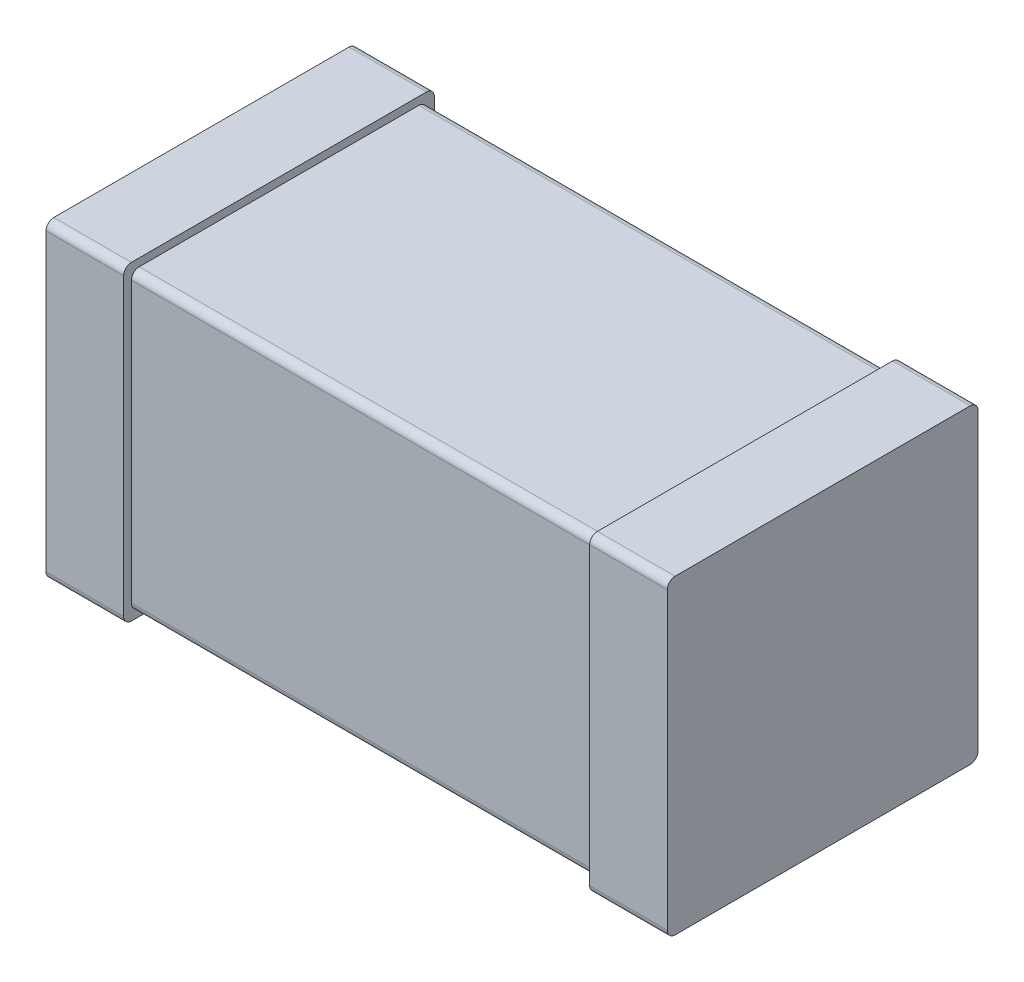
ISO-10303-21;
HEADER;
FILE_DESCRIPTION(('STEP AP214'),'2;1');
FILE_NAME('part.step','',(''),(''),'','','');
FILE_SCHEMA(('AUTOMOTIVE_DESIGN { 1 0 10303 214 1 1 1 1 }'));
ENDSEC;
DATA;
#1=APPLICATION_CONTEXT('core data for automotive mechanical design processes');
#2=APPLICATION_PROTOCOL_DEFINITION('international standard','automotive_design',2000,#1);
#3=PRODUCT_CONTEXT('',#1,'mechanical');
#4=PRODUCT('Part','Part','',(#3));
#5=PRODUCT_RELATED_PRODUCT_CATEGORY('part','',(#4));
#6=PRODUCT_DEFINITION_FORMATION('','',#4);
#7=PRODUCT_DEFINITION_CONTEXT('part definition',#1,'design');
#8=PRODUCT_DEFINITION('design','',#6,#7);
#9=PRODUCT_DEFINITION_SHAPE('','',#8);
#10=(LENGTH_UNIT() NAMED_UNIT(*) SI_UNIT(.MILLI.,.METRE.));
#11=(NAMED_UNIT(*) PLANE_ANGLE_UNIT() SI_UNIT($,.RADIAN.));
#12=(NAMED_UNIT(*) SI_UNIT($,.STERADIAN.) SOLID_ANGLE_UNIT());
#13=UNCERTAINTY_MEASURE_WITH_UNIT(LENGTH_MEASURE(1.E-05),#10,'distance_accuracy_value','');
#14=(GEOMETRIC_REPRESENTATION_CONTEXT(3) GLOBAL_UNCERTAINTY_ASSIGNED_CONTEXT((#13)) GLOBAL_UNIT_ASSIGNED_CONTEXT((#10,
#11,#12)) REPRESENTATION_CONTEXT('',''));
#15=CARTESIAN_POINT('',(0.,0.,0.));
#16=DIRECTION('',(0.,0.,1.));
#17=DIRECTION('',(1.,0.,0.));
#18=AXIS2_PLACEMENT_3D('',#15,#16,#17);
#19=CARTESIAN_POINT('',(-1.6,-0.8,0.));
#20=DIRECTION('',(1.,0.,0.));
#21=DIRECTION('',(0.,1.,0.));
#22=AXIS2_PLACEMENT_3D('',#19,#20,#21);
#23=PLANE('',#22);
#24=CARTESIAN_POINT('',(-1.6,-0.76,1.56));
#25=DIRECTION('',(-1.,0.,0.));
#26=DIRECTION('',(0.,0.,1.));
#27=AXIS2_PLACEMENT_3D('',#24,#25,#26);
#28=CIRCLE('',#27,0.04);
#29=CARTESIAN_POINT('',(-1.6,-0.8,1.56));
#30=VERTEX_POINT('',#29);
#31=CARTESIAN_POINT('',(-1.6,-0.76,1.6));
#32=VERTEX_POINT('',#31);
#33=EDGE_CURVE('E11',#30,#32,#28,.T.);
#34=ORIENTED_EDGE('',*,*,#33,.T.);
#35=DIRECTION('',(0.,1.,0.));
#36=VECTOR('',#35,1.);
#37=CARTESIAN_POINT('',(-1.6,-0.8,1.6));
#38=LINE('',#37,#36);
#39=CARTESIAN_POINT('',(-1.6,0.76,1.6));
#40=VERTEX_POINT('',#39);
#41=EDGE_CURVE('E27',#32,#40,#38,.T.);
#42=ORIENTED_EDGE('',*,*,#41,.T.);
#43=CARTESIAN_POINT('',(-1.6,0.76,1.56));
#44=DIRECTION('',(1.,0.,0.));
#45=DIRECTION('',(0.,0.,1.));
#46=AXIS2_PLACEMENT_3D('',#43,#44,#45);
#47=CIRCLE('',#46,0.04);
#48=CARTESIAN_POINT('',(-1.6,0.8,1.56));
#49=VERTEX_POINT('',#48);
#50=EDGE_CURVE('E420',#49,#40,#47,.T.);
#51=ORIENTED_EDGE('',*,*,#50,.F.);
#52=DIRECTION('',(0.,0.,1.));
#53=VECTOR('',#52,1.);
#54=CARTESIAN_POINT('',(-1.6,0.8,0.));
#55=LINE('',#54,#53);
#56=CARTESIAN_POINT('',(-1.6,0.8,0.04));
#57=VERTEX_POINT('',#56);
#58=EDGE_CURVE('E253',#57,#49,#55,.T.);
#59=ORIENTED_EDGE('',*,*,#58,.F.);
#60=CARTESIAN_POINT('',(-1.6,0.76,0.04));
#61=DIRECTION('',(-1.,0.,0.));
#62=DIRECTION('',(0.,0.,1.));
#63=AXIS2_PLACEMENT_3D('',#60,#61,#62);
#64=CIRCLE('',#63,0.04);
#65=CARTESIAN_POINT('',(-1.6,0.76,0.));
#66=VERTEX_POINT('',#65);
#67=EDGE_CURVE('E292',#57,#66,#64,.T.);
#68=ORIENTED_EDGE('',*,*,#67,.T.);
#69=DIRECTION('',(0.,1.,0.));
#70=VECTOR('',#69,1.);
#71=CARTESIAN_POINT('',(-1.6,-0.8,0.));
#72=LINE('',#71,#70);
#73=CARTESIAN_POINT('',(-1.6,-0.76,0.));
#74=VERTEX_POINT('',#73);
#75=EDGE_CURVE('E309',#74,#66,#72,.T.);
#76=ORIENTED_EDGE('',*,*,#75,.F.);
#77=CARTESIAN_POINT('',(-1.6,-0.76,0.04));
#78=DIRECTION('',(1.,0.,0.));
#79=DIRECTION('',(0.,0.,1.));
#80=AXIS2_PLACEMENT_3D('',#77,#78,#79);
#81=CIRCLE('',#80,0.04);
#82=CARTESIAN_POINT('',(-1.6,-0.8,0.04));
#83=VERTEX_POINT('',#82);
#84=EDGE_CURVE('E230',#83,#74,#81,.T.);
#85=ORIENTED_EDGE('',*,*,#84,.F.);
#86=DIRECTION('',(0.,0.,1.));
#87=VECTOR('',#86,1.);
#88=CARTESIAN_POINT('',(-1.6,-0.8,0.));
#89=LINE('',#88,#87);
#90=EDGE_CURVE('E235',#83,#30,#89,.T.);
#91=ORIENTED_EDGE('',*,*,#90,.T.);
#92=EDGE_LOOP('',(#34,#42,#51,#59,#68,#76,#85,#91));
#93=FACE_BOUND('',#92,.T.);
#94=ADVANCED_FACE('F16',(#93),#23,.F.);
#95=CARTESIAN_POINT('',(-1.6,-0.8,0.));
#96=DIRECTION('',(0.,1.,0.));
#97=DIRECTION('',(1.,0.,0.));
#98=AXIS2_PLACEMENT_3D('',#95,#96,#97);
#99=PLANE('',#98);
#100=DIRECTION('',(1.,0.,0.));
#101=VECTOR('',#100,1.);
#102=CARTESIAN_POINT('',(-1.6,-0.8,1.56));
#103=LINE('',#102,#101);
#104=CARTESIAN_POINT('',(-1.2,-0.8,1.56));
#105=VERTEX_POINT('',#104);
#106=EDGE_CURVE('E286',#30,#105,#103,.T.);
#107=ORIENTED_EDGE('',*,*,#106,.F.);
#108=ORIENTED_EDGE('',*,*,#90,.F.);
#109=DIRECTION('',(1.,0.,0.));
#110=VECTOR('',#109,1.);
#111=CARTESIAN_POINT('',(-1.6,-0.8,0.04));
#112=LINE('',#111,#110);
#113=CARTESIAN_POINT('',(-1.2,-0.8,0.04));
#114=VERTEX_POINT('',#113);
#115=EDGE_CURVE('E229',#83,#114,#112,.T.);
#116=ORIENTED_EDGE('',*,*,#115,.T.);
#117=DIRECTION('',(0.,0.,1.));
#118=VECTOR('',#117,1.);
#119=CARTESIAN_POINT('',(-1.2,-0.8,0.));
#120=LINE('',#119,#118);
#121=EDGE_CURVE('E220',#114,#105,#120,.T.);
#122=ORIENTED_EDGE('',*,*,#121,.T.);
#123=EDGE_LOOP('',(#107,#108,#116,#122));
#124=FACE_BOUND('',#123,.T.);
#125=ADVANCED_FACE('F234',(#124),#99,.F.);
#126=CARTESIAN_POINT('',(-1.6,-0.76,0.04));
#127=DIRECTION('',(1.,0.,0.));
#128=DIRECTION('',(0.,-1.,0.));
#129=AXIS2_PLACEMENT_3D('',#126,#127,#128);
#130=CYLINDRICAL_SURFACE('',#129,0.04);
#131=ORIENTED_EDGE('',*,*,#84,.T.);
#132=DIRECTION('',(1.,0.,0.));
#133=VECTOR('',#132,1.);
#134=CARTESIAN_POINT('',(-1.6,-0.76,0.));
#135=LINE('',#134,#133);
#136=CARTESIAN_POINT('',(-1.2,-0.76,0.));
#137=VERTEX_POINT('',#136);
#138=EDGE_CURVE('E242',#74,#137,#135,.T.);
#139=ORIENTED_EDGE('',*,*,#138,.T.);
#140=CARTESIAN_POINT('',(-1.2,-0.76,0.04));
#141=DIRECTION('',(1.,0.,0.));
#142=DIRECTION('',(0.,0.,1.));
#143=AXIS2_PLACEMENT_3D('',#140,#141,#142);
#144=CIRCLE('',#143,0.04);
#145=EDGE_CURVE('E159',#114,#137,#144,.T.);
#146=ORIENTED_EDGE('',*,*,#145,.F.);
#147=ORIENTED_EDGE('',*,*,#115,.F.);
#148=EDGE_LOOP('',(#131,#139,#146,#147));
#149=FACE_BOUND('',#148,.T.);
#150=ADVANCED_FACE('F240',(#149),#130,.T.);
#151=CARTESIAN_POINT('',(-1.6,-0.76,1.56));
#152=DIRECTION('',(1.,0.,0.));
#153=DIRECTION('',(0.,-1.,0.));
#154=AXIS2_PLACEMENT_3D('',#151,#152,#153);
#155=CYLINDRICAL_SURFACE('',#154,0.04);
#156=ORIENTED_EDGE('',*,*,#106,.T.);
#157=CARTESIAN_POINT('',(-1.2,-0.76,1.56));
#158=DIRECTION('',(-1.,0.,0.));
#159=DIRECTION('',(0.,0.,1.));
#160=AXIS2_PLACEMENT_3D('',#157,#158,#159);
#161=CIRCLE('',#160,0.04);
#162=CARTESIAN_POINT('',(-1.2,-0.76,1.6));
#163=VERTEX_POINT('',#162);
#164=EDGE_CURVE('E225',#105,#163,#161,.T.);
#165=ORIENTED_EDGE('',*,*,#164,.T.);
#166=DIRECTION('',(1.,0.,0.));
#167=VECTOR('',#166,1.);
#168=CARTESIAN_POINT('',(-1.6,-0.76,1.6));
#169=LINE('',#168,#167);
#170=EDGE_CURVE('E172',#32,#163,#169,.T.);
#171=ORIENTED_EDGE('',*,*,#170,.F.);
#172=ORIENTED_EDGE('',*,*,#33,.F.);
#173=EDGE_LOOP('',(#156,#165,#171,#172));
#174=FACE_BOUND('',#173,.T.);
#175=ADVANCED_FACE('F502',(#174),#155,.T.);
#176=CARTESIAN_POINT('',(-1.6,-0.8,0.));
#177=DIRECTION('',(0.,0.,1.));
#178=DIRECTION('',(1.,0.,0.));
#179=AXIS2_PLACEMENT_3D('',#176,#177,#178);
#180=PLANE('',#179);
#181=DIRECTION('',(1.,0.,0.));
#182=VECTOR('',#181,1.);
#183=CARTESIAN_POINT('',(-1.6,0.76,0.));
#184=LINE('',#183,#182);
#185=CARTESIAN_POINT('',(-1.2,0.76,0.));
#186=VERTEX_POINT('',#185);
#187=EDGE_CURVE('E504',#66,#186,#184,.T.);
#188=ORIENTED_EDGE('',*,*,#187,.T.);
#189=DIRECTION('',(0.,1.,0.));
#190=VECTOR('',#189,1.);
#191=CARTESIAN_POINT('',(-1.2,-0.8,0.));
#192=LINE('',#191,#190);
#193=EDGE_CURVE('E246',#137,#186,#192,.T.);
#194=ORIENTED_EDGE('',*,*,#193,.F.);
#195=ORIENTED_EDGE('',*,*,#138,.F.);
#196=ORIENTED_EDGE('',*,*,#75,.T.);
#197=EDGE_LOOP('',(#188,#194,#195,#196));
#198=FACE_BOUND('',#197,.T.);
#199=ADVANCED_FACE('F519',(#198),#180,.F.);
#200=CARTESIAN_POINT('',(-1.6,-0.8,1.6));
#201=DIRECTION('',(0.,0.,1.));
#202=DIRECTION('',(1.,0.,0.));
#203=AXIS2_PLACEMENT_3D('',#200,#201,#202);
#204=PLANE('',#203);
#205=ORIENTED_EDGE('',*,*,#41,.F.);
#206=ORIENTED_EDGE('',*,*,#170,.T.);
#207=DIRECTION('',(0.,1.,0.));
#208=VECTOR('',#207,1.);
#209=CARTESIAN_POINT('',(-1.2,-0.8,1.6));
#210=LINE('',#209,#208);
#211=CARTESIAN_POINT('',(-1.2,0.76,1.6));
#212=VERTEX_POINT('',#211);
#213=EDGE_CURVE('E265',#163,#212,#210,.T.);
#214=ORIENTED_EDGE('',*,*,#213,.T.);
#215=DIRECTION('',(1.,0.,0.));
#216=VECTOR('',#215,1.);
#217=CARTESIAN_POINT('',(-1.6,0.76,1.6));
#218=LINE('',#217,#216);
#219=EDGE_CURVE('E330',#40,#212,#218,.T.);
#220=ORIENTED_EDGE('',*,*,#219,.F.);
#221=EDGE_LOOP('',(#205,#206,#214,#220));
#222=FACE_BOUND('',#221,.T.);
#223=ADVANCED_FACE('F491',(#222),#204,.T.);
#224=CARTESIAN_POINT('',(-1.6,0.76,0.04));
#225=DIRECTION('',(1.,0.,0.));
#226=DIRECTION('',(0.,1.,0.));
#227=AXIS2_PLACEMENT_3D('',#224,#225,#226);
#228=CYLINDRICAL_SURFACE('',#227,0.04);
#229=DIRECTION('',(1.,0.,0.));
#230=VECTOR('',#229,1.);
#231=CARTESIAN_POINT('',(-1.6,0.8,0.04));
#232=LINE('',#231,#230);
#233=CARTESIAN_POINT('',(-1.2,0.8,0.04));
#234=VERTEX_POINT('',#233);
#235=EDGE_CURVE('E262',#57,#234,#232,.T.);
#236=ORIENTED_EDGE('',*,*,#235,.T.);
#237=CARTESIAN_POINT('',(-1.2,0.76,0.04));
#238=DIRECTION('',(-1.,0.,0.));
#239=DIRECTION('',(0.,0.,1.));
#240=AXIS2_PLACEMENT_3D('',#237,#238,#239);
#241=CIRCLE('',#240,0.04);
#242=EDGE_CURVE('E266',#234,#186,#241,.T.);
#243=ORIENTED_EDGE('',*,*,#242,.T.);
#244=ORIENTED_EDGE('',*,*,#187,.F.);
#245=ORIENTED_EDGE('',*,*,#67,.F.);
#246=EDGE_LOOP('',(#236,#243,#244,#245));
#247=FACE_BOUND('',#246,.T.);
#248=ADVANCED_FACE('F522',(#247),#228,.T.);
#249=CARTESIAN_POINT('',(-1.6,0.76,1.56));
#250=DIRECTION('',(1.,0.,0.));
#251=DIRECTION('',(0.,1.,0.));
#252=AXIS2_PLACEMENT_3D('',#249,#250,#251);
#253=CYLINDRICAL_SURFACE('',#252,0.04);
#254=ORIENTED_EDGE('',*,*,#50,.T.);
#255=ORIENTED_EDGE('',*,*,#219,.T.);
#256=CARTESIAN_POINT('',(-1.2,0.76,1.56));
#257=DIRECTION('',(1.,0.,0.));
#258=DIRECTION('',(0.,0.,1.));
#259=AXIS2_PLACEMENT_3D('',#256,#257,#258);
#260=CIRCLE('',#259,0.04);
#261=CARTESIAN_POINT('',(-1.2,0.8,1.56));
#262=VERTEX_POINT('',#261);
#263=EDGE_CURVE('E267',#262,#212,#260,.T.);
#264=ORIENTED_EDGE('',*,*,#263,.F.);
#265=DIRECTION('',(1.,0.,0.));
#266=VECTOR('',#265,1.);
#267=CARTESIAN_POINT('',(-1.6,0.8,1.56));
#268=LINE('',#267,#266);
#269=EDGE_CURVE('E245',#49,#262,#268,.T.);
#270=ORIENTED_EDGE('',*,*,#269,.F.);
#271=EDGE_LOOP('',(#254,#255,#264,#270));
#272=FACE_BOUND('',#271,.T.);
#273=ADVANCED_FACE('F488',(#272),#253,.T.);
#274=CARTESIAN_POINT('',(-1.6,0.8,0.));
#275=DIRECTION('',(0.,1.,0.));
#276=DIRECTION('',(1.,0.,0.));
#277=AXIS2_PLACEMENT_3D('',#274,#275,#276);
#278=PLANE('',#277);
#279=DIRECTION('',(0.,0.,1.));
#280=VECTOR('',#279,1.);
#281=CARTESIAN_POINT('',(-1.2,0.8,0.));
#282=LINE('',#281,#280);
#283=EDGE_CURVE('E256',#234,#262,#282,.T.);
#284=ORIENTED_EDGE('',*,*,#283,.F.);
#285=ORIENTED_EDGE('',*,*,#235,.F.);
#286=ORIENTED_EDGE('',*,*,#58,.T.);
#287=ORIENTED_EDGE('',*,*,#269,.T.);
#288=EDGE_LOOP('',(#284,#285,#286,#287));
#289=FACE_BOUND('',#288,.T.);
#290=ADVANCED_FACE('F496',(#289),#278,.T.);
#291=CARTESIAN_POINT('',(-1.2,-0.8,0.));
#292=DIRECTION('',(1.,0.,0.));
#293=DIRECTION('',(0.,1.,0.));
#294=AXIS2_PLACEMENT_3D('',#291,#292,#293);
#295=PLANE('',#294);
#296=ORIENTED_EDGE('',*,*,#121,.F.);
#297=ORIENTED_EDGE('',*,*,#145,.T.);
#298=ORIENTED_EDGE('',*,*,#193,.T.);
#299=ORIENTED_EDGE('',*,*,#242,.F.);
#300=ORIENTED_EDGE('',*,*,#283,.T.);
#301=ORIENTED_EDGE('',*,*,#263,.T.);
#302=ORIENTED_EDGE('',*,*,#213,.F.);
#303=ORIENTED_EDGE('',*,*,#164,.F.);
#304=EDGE_LOOP('',(#296,#297,#298,#299,#300,#301,#302,#303));
#305=FACE_BOUND('',#304,.T.);
#306=CARTESIAN_POINT('',(-1.2,-0.72,0.08));
#307=DIRECTION('',(1.,0.,0.));
#308=DIRECTION('',(0.,0.,1.));
#309=AXIS2_PLACEMENT_3D('',#306,#307,#308);
#310=CIRCLE('',#309,0.04);
#311=CARTESIAN_POINT('',(-1.2,-0.76,0.08));
#312=VERTEX_POINT('',#311);
#313=CARTESIAN_POINT('',(-1.2,-0.72,0.04));
#314=VERTEX_POINT('',#313);
#315=EDGE_CURVE('E346',#312,#314,#310,.T.);
#316=ORIENTED_EDGE('',*,*,#315,.F.);
#317=DIRECTION('',(0.,0.,1.));
#318=VECTOR('',#317,1.);
#319=CARTESIAN_POINT('',(-1.2,-0.76,0.04));
#320=LINE('',#319,#318);
#321=CARTESIAN_POINT('',(-1.2,-0.76,1.52));
#322=VERTEX_POINT('',#321);
#323=EDGE_CURVE('E271',#312,#322,#320,.T.);
#324=ORIENTED_EDGE('',*,*,#323,.T.);
#325=CARTESIAN_POINT('',(-1.2,-0.72,1.52));
#326=DIRECTION('',(-1.,0.,0.));
#327=DIRECTION('',(0.,0.,1.));
#328=AXIS2_PLACEMENT_3D('',#325,#326,#327);
#329=CIRCLE('',#328,0.04);
#330=CARTESIAN_POINT('',(-1.2,-0.72,1.56));
#331=VERTEX_POINT('',#330);
#332=EDGE_CURVE('E331',#322,#331,#329,.T.);
#333=ORIENTED_EDGE('',*,*,#332,.T.);
#334=DIRECTION('',(0.,1.,0.));
#335=VECTOR('',#334,1.);
#336=CARTESIAN_POINT('',(-1.2,-0.76,1.56));
#337=LINE('',#336,#335);
#338=CARTESIAN_POINT('',(-1.2,0.72,1.56));
#339=VERTEX_POINT('',#338);
#340=EDGE_CURVE('E335',#331,#339,#337,.T.);
#341=ORIENTED_EDGE('',*,*,#340,.T.);
#342=CARTESIAN_POINT('',(-1.2,0.72,1.52));
#343=DIRECTION('',(1.,0.,0.));
#344=DIRECTION('',(0.,0.,1.));
#345=AXIS2_PLACEMENT_3D('',#342,#343,#344);
#346=CIRCLE('',#345,0.04);
#347=CARTESIAN_POINT('',(-1.2,0.76,1.52));
#348=VERTEX_POINT('',#347);
#349=EDGE_CURVE('E282',#348,#339,#346,.T.);
#350=ORIENTED_EDGE('',*,*,#349,.F.);
#351=DIRECTION('',(0.,0.,1.));
#352=VECTOR('',#351,1.);
#353=CARTESIAN_POINT('',(-1.2,0.76,0.04));
#354=LINE('',#353,#352);
#355=CARTESIAN_POINT('',(-1.2,0.76,0.08));
#356=VERTEX_POINT('',#355);
#357=EDGE_CURVE('E277',#356,#348,#354,.T.);
#358=ORIENTED_EDGE('',*,*,#357,.F.);
#359=CARTESIAN_POINT('',(-1.2,0.72,0.08));
#360=DIRECTION('',(-1.,0.,0.));
#361=DIRECTION('',(0.,0.,1.));
#362=AXIS2_PLACEMENT_3D('',#359,#360,#361);
#363=CIRCLE('',#362,0.04);
#364=CARTESIAN_POINT('',(-1.2,0.72,0.04));
#365=VERTEX_POINT('',#364);
#366=EDGE_CURVE('E342',#356,#365,#363,.T.);
#367=ORIENTED_EDGE('',*,*,#366,.T.);
#368=DIRECTION('',(0.,1.,0.));
#369=VECTOR('',#368,1.);
#370=CARTESIAN_POINT('',(-1.2,-0.76,0.04));
#371=LINE('',#370,#369);
#372=EDGE_CURVE('E381',#314,#365,#371,.T.);
#373=ORIENTED_EDGE('',*,*,#372,.F.);
#374=EDGE_LOOP('',(#316,#324,#333,#341,#350,#358,#367,#373));
#375=FACE_BOUND('',#374,.T.);
#376=ADVANCED_FACE('F222',(#305,#375),#295,.T.);
#377=CARTESIAN_POINT('',(-1.2,-0.72,0.08));
#378=DIRECTION('',(1.,0.,0.));
#379=DIRECTION('',(0.,-1.,0.));
#380=AXIS2_PLACEMENT_3D('',#377,#378,#379);
#381=CYLINDRICAL_SURFACE('',#380,0.04);
#382=ORIENTED_EDGE('',*,*,#315,.T.);
#383=DIRECTION('',(1.,0.,0.));
#384=VECTOR('',#383,1.);
#385=CARTESIAN_POINT('',(-1.2,-0.72,0.04));
#386=LINE('',#385,#384);
#387=CARTESIAN_POINT('',(1.2,-0.72,0.04));
#388=VERTEX_POINT('',#387);
#389=EDGE_CURVE('E380',#314,#388,#386,.T.);
#390=ORIENTED_EDGE('',*,*,#389,.T.);
#391=CARTESIAN_POINT('',(1.2,-0.72,0.08));
#392=DIRECTION('',(1.,0.,0.));
#393=DIRECTION('',(0.,0.,1.));
#394=AXIS2_PLACEMENT_3D('',#391,#392,#393);
#395=CIRCLE('',#394,0.04);
#396=CARTESIAN_POINT('',(1.2,-0.76,0.08));
#397=VERTEX_POINT('',#396);
#398=EDGE_CURVE('E128',#397,#388,#395,.T.);
#399=ORIENTED_EDGE('',*,*,#398,.F.);
#400=DIRECTION('',(1.,0.,0.));
#401=VECTOR('',#400,1.);
#402=CARTESIAN_POINT('',(-1.2,-0.76,0.08));
#403=LINE('',#402,#401);
#404=EDGE_CURVE('E340',#312,#397,#403,.T.);
#405=ORIENTED_EDGE('',*,*,#404,.F.);
#406=EDGE_LOOP('',(#382,#390,#399,#405));
#407=FACE_BOUND('',#406,.T.);
#408=ADVANCED_FACE('F548',(#407),#381,.T.);
#409=CARTESIAN_POINT('',(-1.2,-0.76,0.04));
#410=DIRECTION('',(0.,0.,1.));
#411=DIRECTION('',(1.,0.,0.));
#412=AXIS2_PLACEMENT_3D('',#409,#410,#411);
#413=PLANE('',#412);
#414=DIRECTION('',(1.,0.,0.));
#415=VECTOR('',#414,1.);
#416=CARTESIAN_POINT('',(-1.2,0.72,0.04));
#417=LINE('',#416,#415);
#418=CARTESIAN_POINT('',(1.2,0.72,0.04));
#419=VERTEX_POINT('',#418);
#420=EDGE_CURVE('E377',#365,#419,#417,.T.);
#421=ORIENTED_EDGE('',*,*,#420,.T.);
#422=DIRECTION('',(0.,1.,0.));
#423=VECTOR('',#422,1.);
#424=CARTESIAN_POINT('',(1.2,-0.76,0.04));
#425=LINE('',#424,#423);
#426=EDGE_CURVE('E141',#388,#419,#425,.T.);
#427=ORIENTED_EDGE('',*,*,#426,.F.);
#428=ORIENTED_EDGE('',*,*,#389,.F.);
#429=ORIENTED_EDGE('',*,*,#372,.T.);
#430=EDGE_LOOP('',(#421,#427,#428,#429));
#431=FACE_BOUND('',#430,.T.);
#432=ADVANCED_FACE('F573',(#431),#413,.F.);
#433=CARTESIAN_POINT('',(-1.2,0.72,0.08));
#434=DIRECTION('',(1.,0.,0.));
#435=DIRECTION('',(0.,1.,0.));
#436=AXIS2_PLACEMENT_3D('',#433,#434,#435);
#437=CYLINDRICAL_SURFACE('',#436,0.04);
#438=DIRECTION('',(1.,0.,0.));
#439=VECTOR('',#438,1.);
#440=CARTESIAN_POINT('',(-1.2,0.76,0.08));
#441=LINE('',#440,#439);
#442=CARTESIAN_POINT('',(1.2,0.76,0.08));
#443=VERTEX_POINT('',#442);
#444=EDGE_CURVE('E276',#356,#443,#441,.T.);
#445=ORIENTED_EDGE('',*,*,#444,.T.);
#446=CARTESIAN_POINT('',(1.2,0.72,0.08));
#447=DIRECTION('',(-1.,0.,0.));
#448=DIRECTION('',(0.,0.,1.));
#449=AXIS2_PLACEMENT_3D('',#446,#447,#448);
#450=CIRCLE('',#449,0.04);
#451=EDGE_CURVE('E272',#443,#419,#450,.T.);
#452=ORIENTED_EDGE('',*,*,#451,.T.);
#453=ORIENTED_EDGE('',*,*,#420,.F.);
#454=ORIENTED_EDGE('',*,*,#366,.F.);
#455=EDGE_LOOP('',(#445,#452,#453,#454));
#456=FACE_BOUND('',#455,.T.);
#457=ADVANCED_FACE('F575',(#456),#437,.T.);
#458=CARTESIAN_POINT('',(-1.2,0.76,0.04));
#459=DIRECTION('',(0.,1.,0.));
#460=DIRECTION('',(1.,0.,0.));
#461=AXIS2_PLACEMENT_3D('',#458,#459,#460);
#462=PLANE('',#461);
#463=DIRECTION('',(0.,0.,1.));
#464=VECTOR('',#463,1.);
#465=CARTESIAN_POINT('',(1.2,0.76,0.04));
#466=LINE('',#465,#464);
#467=CARTESIAN_POINT('',(1.2,0.76,1.52));
#468=VERTEX_POINT('',#467);
#469=EDGE_CURVE('E321',#443,#468,#466,.T.);
#470=ORIENTED_EDGE('',*,*,#469,.F.);
#471=ORIENTED_EDGE('',*,*,#444,.F.);
#472=ORIENTED_EDGE('',*,*,#357,.T.);
#473=DIRECTION('',(1.,0.,0.));
#474=VECTOR('',#473,1.);
#475=CARTESIAN_POINT('',(-1.2,0.76,1.52));
#476=LINE('',#475,#474);
#477=EDGE_CURVE('E312',#348,#468,#476,.T.);
#478=ORIENTED_EDGE('',*,*,#477,.T.);
#479=EDGE_LOOP('',(#470,#471,#472,#478));
#480=FACE_BOUND('',#479,.T.);
#481=ADVANCED_FACE('F580',(#480),#462,.T.);
#482=CARTESIAN_POINT('',(-1.2,0.72,1.52));
#483=DIRECTION('',(1.,0.,0.));
#484=DIRECTION('',(0.,1.,0.));
#485=AXIS2_PLACEMENT_3D('',#482,#483,#484);
#486=CYLINDRICAL_SURFACE('',#485,0.04);
#487=ORIENTED_EDGE('',*,*,#349,.T.);
#488=DIRECTION('',(1.,0.,0.));
#489=VECTOR('',#488,1.);
#490=CARTESIAN_POINT('',(-1.2,0.72,1.56));
#491=LINE('',#490,#489);
#492=CARTESIAN_POINT('',(1.2,0.72,1.56));
#493=VERTEX_POINT('',#492);
#494=EDGE_CURVE('E278',#339,#493,#491,.T.);
#495=ORIENTED_EDGE('',*,*,#494,.T.);
#496=CARTESIAN_POINT('',(1.2,0.72,1.52));
#497=DIRECTION('',(1.,0.,0.));
#498=DIRECTION('',(0.,0.,1.));
#499=AXIS2_PLACEMENT_3D('',#496,#497,#498);
#500=CIRCLE('',#499,0.04);
#501=EDGE_CURVE('E319',#468,#493,#500,.T.);
#502=ORIENTED_EDGE('',*,*,#501,.F.);
#503=ORIENTED_EDGE('',*,*,#477,.F.);
#504=EDGE_LOOP('',(#487,#495,#502,#503));
#505=FACE_BOUND('',#504,.T.);
#506=ADVANCED_FACE('F583',(#505),#486,.T.);
#507=CARTESIAN_POINT('',(-1.2,-0.76,1.56));
#508=DIRECTION('',(0.,0.,1.));
#509=DIRECTION('',(1.,0.,0.));
#510=AXIS2_PLACEMENT_3D('',#507,#508,#509);
#511=PLANE('',#510);
#512=ORIENTED_EDGE('',*,*,#340,.F.);
#513=DIRECTION('',(1.,0.,0.));
#514=VECTOR('',#513,1.);
#515=CARTESIAN_POINT('',(-1.2,-0.72,1.56));
#516=LINE('',#515,#514);
#517=CARTESIAN_POINT('',(1.2,-0.72,1.56));
#518=VERTEX_POINT('',#517);
#519=EDGE_CURVE('E283',#331,#518,#516,.T.);
#520=ORIENTED_EDGE('',*,*,#519,.T.);
#521=DIRECTION('',(0.,1.,0.));
#522=VECTOR('',#521,1.);
#523=CARTESIAN_POINT('',(1.2,-0.76,1.56));
#524=LINE('',#523,#522);
#525=EDGE_CURVE('E67',#518,#493,#524,.T.);
#526=ORIENTED_EDGE('',*,*,#525,.T.);
#527=ORIENTED_EDGE('',*,*,#494,.F.);
#528=EDGE_LOOP('',(#512,#520,#526,#527));
#529=FACE_BOUND('',#528,.T.);
#530=ADVANCED_FACE('F587',(#529),#511,.T.);
#531=CARTESIAN_POINT('',(-1.2,-0.72,1.52));
#532=DIRECTION('',(1.,0.,0.));
#533=DIRECTION('',(0.,-1.,0.));
#534=AXIS2_PLACEMENT_3D('',#531,#532,#533);
#535=CYLINDRICAL_SURFACE('',#534,0.04);
#536=DIRECTION('',(1.,0.,0.));
#537=VECTOR('',#536,1.);
#538=CARTESIAN_POINT('',(-1.2,-0.76,1.52));
#539=LINE('',#538,#537);
#540=CARTESIAN_POINT('',(1.2,-0.76,1.52));
#541=VERTEX_POINT('',#540);
#542=EDGE_CURVE('E325',#322,#541,#539,.T.);
#543=ORIENTED_EDGE('',*,*,#542,.T.);
#544=CARTESIAN_POINT('',(1.2,-0.72,1.52));
#545=DIRECTION('',(-1.,0.,0.));
#546=DIRECTION('',(0.,0.,1.));
#547=AXIS2_PLACEMENT_3D('',#544,#545,#546);
#548=CIRCLE('',#547,0.04);
#549=EDGE_CURVE('E80',#541,#518,#548,.T.);
#550=ORIENTED_EDGE('',*,*,#549,.T.);
#551=ORIENTED_EDGE('',*,*,#519,.F.);
#552=ORIENTED_EDGE('',*,*,#332,.F.);
#553=EDGE_LOOP('',(#543,#550,#551,#552));
#554=FACE_BOUND('',#553,.T.);
#555=ADVANCED_FACE('F564',(#554),#535,.T.);
#556=CARTESIAN_POINT('',(-1.2,-0.76,0.04));
#557=DIRECTION('',(0.,1.,0.));
#558=DIRECTION('',(1.,0.,0.));
#559=AXIS2_PLACEMENT_3D('',#556,#557,#558);
#560=PLANE('',#559);
#561=ORIENTED_EDGE('',*,*,#542,.F.);
#562=ORIENTED_EDGE('',*,*,#323,.F.);
#563=ORIENTED_EDGE('',*,*,#404,.T.);
#564=DIRECTION('',(0.,0.,1.));
#565=VECTOR('',#564,1.);
#566=CARTESIAN_POINT('',(1.2,-0.76,0.04));
#567=LINE('',#566,#565);
#568=EDGE_CURVE('E336',#397,#541,#567,.T.);
#569=ORIENTED_EDGE('',*,*,#568,.T.);
#570=EDGE_LOOP('',(#561,#562,#563,#569));
#571=FACE_BOUND('',#570,.T.);
#572=ADVANCED_FACE('F561',(#571),#560,.F.);
#573=CARTESIAN_POINT('',(1.2,-0.8,0.));
#574=DIRECTION('',(1.,0.,0.));
#575=DIRECTION('',(0.,1.,0.));
#576=AXIS2_PLACEMENT_3D('',#573,#574,#575);
#577=PLANE('',#576);
#578=CARTESIAN_POINT('',(1.2,-0.76,1.56));
#579=DIRECTION('',(-1.,0.,0.));
#580=DIRECTION('',(0.,0.,1.));
#581=AXIS2_PLACEMENT_3D('',#578,#579,#580);
#582=CIRCLE('',#581,0.04);
#583=CARTESIAN_POINT('',(1.2,-0.8,1.56));
#584=VERTEX_POINT('',#583);
#585=CARTESIAN_POINT('',(1.2,-0.76,1.6));
#586=VERTEX_POINT('',#585);
#587=EDGE_CURVE('E341',#584,#586,#582,.T.);
#588=ORIENTED_EDGE('',*,*,#587,.T.);
#589=DIRECTION('',(0.,1.,0.));
#590=VECTOR('',#589,1.);
#591=CARTESIAN_POINT('',(1.2,-0.8,1.6));
#592=LINE('',#591,#590);
#593=CARTESIAN_POINT('',(1.2,0.76,1.6));
#594=VERTEX_POINT('',#593);
#595=EDGE_CURVE('E353',#586,#594,#592,.T.);
#596=ORIENTED_EDGE('',*,*,#595,.T.);
#597=CARTESIAN_POINT('',(1.2,0.76,1.56));
#598=DIRECTION('',(1.,0.,0.));
#599=DIRECTION('',(0.,0.,1.));
#600=AXIS2_PLACEMENT_3D('',#597,#598,#599);
#601=CIRCLE('',#600,0.04);
#602=CARTESIAN_POINT('',(1.2,0.8,1.56));
#603=VERTEX_POINT('',#602);
#604=EDGE_CURVE('E382',#603,#594,#601,.T.);
#605=ORIENTED_EDGE('',*,*,#604,.F.);
#606=DIRECTION('',(0.,0.,1.));
#607=VECTOR('',#606,1.);
#608=CARTESIAN_POINT('',(1.2,0.8,0.));
#609=LINE('',#608,#607);
#610=CARTESIAN_POINT('',(1.2,0.8,0.04));
#611=VERTEX_POINT('',#610);
#612=EDGE_CURVE('E313',#611,#603,#609,.T.);
#613=ORIENTED_EDGE('',*,*,#612,.F.);
#614=CARTESIAN_POINT('',(1.2,0.76,0.04));
#615=DIRECTION('',(-1.,0.,0.));
#616=DIRECTION('',(0.,0.,1.));
#617=AXIS2_PLACEMENT_3D('',#614,#615,#616);
#618=CIRCLE('',#617,0.04);
#619=CARTESIAN_POINT('',(1.2,0.76,0.));
#620=VERTEX_POINT('',#619);
#621=EDGE_CURVE('E291',#611,#620,#618,.T.);
#622=ORIENTED_EDGE('',*,*,#621,.T.);
#623=DIRECTION('',(0.,1.,0.));
#624=VECTOR('',#623,1.);
#625=CARTESIAN_POINT('',(1.2,-0.8,0.));
#626=LINE('',#625,#624);
#627=CARTESIAN_POINT('',(1.2,-0.76,0.));
#628=VERTEX_POINT('',#627);
#629=EDGE_CURVE('E416',#628,#620,#626,.T.);
#630=ORIENTED_EDGE('',*,*,#629,.F.);
#631=CARTESIAN_POINT('',(1.2,-0.76,0.04));
#632=DIRECTION('',(1.,0.,0.));
#633=DIRECTION('',(0.,0.,1.));
#634=AXIS2_PLACEMENT_3D('',#631,#632,#633);
#635=CIRCLE('',#634,0.04);
#636=CARTESIAN_POINT('',(1.2,-0.8,0.04));
#637=VERTEX_POINT('',#636);
#638=EDGE_CURVE('E305',#637,#628,#635,.T.);
#639=ORIENTED_EDGE('',*,*,#638,.F.);
#640=DIRECTION('',(0.,0.,1.));
#641=VECTOR('',#640,1.);
#642=CARTESIAN_POINT('',(1.2,-0.8,0.));
#643=LINE('',#642,#641);
#644=EDGE_CURVE('E287',#637,#584,#643,.T.);
#645=ORIENTED_EDGE('',*,*,#644,.T.);
#646=EDGE_LOOP('',(#588,#596,#605,#613,#622,#630,#639,#645));
#647=FACE_BOUND('',#646,.T.);
#648=ORIENTED_EDGE('',*,*,#426,.T.);
#649=ORIENTED_EDGE('',*,*,#451,.F.);
#650=ORIENTED_EDGE('',*,*,#469,.T.);
#651=ORIENTED_EDGE('',*,*,#501,.T.);
#652=ORIENTED_EDGE('',*,*,#525,.F.);
#653=ORIENTED_EDGE('',*,*,#549,.F.);
#654=ORIENTED_EDGE('',*,*,#568,.F.);
#655=ORIENTED_EDGE('',*,*,#398,.T.);
#656=EDGE_LOOP('',(#648,#649,#650,#651,#652,#653,#654,#655));
#657=FACE_BOUND('',#656,.T.);
#658=ADVANCED_FACE('F551',(#647,#657),#577,.F.);
#659=CARTESIAN_POINT('',(1.2,-0.8,0.));
#660=DIRECTION('',(0.,1.,0.));
#661=DIRECTION('',(1.,0.,0.));
#662=AXIS2_PLACEMENT_3D('',#659,#660,#661);
#663=PLANE('',#662);
#664=DIRECTION('',(1.,0.,0.));
#665=VECTOR('',#664,1.);
#666=CARTESIAN_POINT('',(1.2,-0.8,1.56));
#667=LINE('',#666,#665);
#668=CARTESIAN_POINT('',(1.6,-0.8,1.56));
#669=VERTEX_POINT('',#668);
#670=EDGE_CURVE('E306',#584,#669,#667,.T.);
#671=ORIENTED_EDGE('',*,*,#670,.F.);
#672=ORIENTED_EDGE('',*,*,#644,.F.);
#673=DIRECTION('',(1.,0.,0.));
#674=VECTOR('',#673,1.);
#675=CARTESIAN_POINT('',(1.2,-0.8,0.04));
#676=LINE('',#675,#674);
#677=CARTESIAN_POINT('',(1.6,-0.8,0.04));
#678=VERTEX_POINT('',#677);
#679=EDGE_CURVE('E296',#637,#678,#676,.T.);
#680=ORIENTED_EDGE('',*,*,#679,.T.);
#681=DIRECTION('',(0.,0.,1.));
#682=VECTOR('',#681,1.);
#683=CARTESIAN_POINT('',(1.6,-0.8,0.));
#684=LINE('',#683,#682);
#685=EDGE_CURVE('E300',#678,#669,#684,.T.);
#686=ORIENTED_EDGE('',*,*,#685,.T.);
#687=EDGE_LOOP('',(#671,#672,#680,#686));
#688=FACE_BOUND('',#687,.T.);
#689=ADVANCED_FACE('F393',(#688),#663,.F.);
#690=CARTESIAN_POINT('',(1.2,-0.76,0.04));
#691=DIRECTION('',(1.,0.,0.));
#692=DIRECTION('',(0.,-1.,0.));
#693=AXIS2_PLACEMENT_3D('',#690,#691,#692);
#694=CYLINDRICAL_SURFACE('',#693,0.04);
#695=ORIENTED_EDGE('',*,*,#638,.T.);
#696=DIRECTION('',(1.,0.,0.));
#697=VECTOR('',#696,1.);
#698=CARTESIAN_POINT('',(1.2,-0.76,0.));
#699=LINE('',#698,#697);
#700=CARTESIAN_POINT('',(1.6,-0.76,0.));
#701=VERTEX_POINT('',#700);
#702=EDGE_CURVE('E301',#628,#701,#699,.T.);
#703=ORIENTED_EDGE('',*,*,#702,.T.);
#704=CARTESIAN_POINT('',(1.6,-0.76,0.04));
#705=DIRECTION('',(1.,0.,0.));
#706=DIRECTION('',(0.,0.,1.));
#707=AXIS2_PLACEMENT_3D('',#704,#705,#706);
#708=CIRCLE('',#707,0.04);
#709=EDGE_CURVE('E376',#678,#701,#708,.T.);
#710=ORIENTED_EDGE('',*,*,#709,.F.);
#711=ORIENTED_EDGE('',*,*,#679,.F.);
#712=EDGE_LOOP('',(#695,#703,#710,#711));
#713=FACE_BOUND('',#712,.T.);
#714=ADVANCED_FACE('F18',(#713),#694,.T.);
#715=CARTESIAN_POINT('',(1.2,-0.76,1.56));
#716=DIRECTION('',(1.,0.,0.));
#717=DIRECTION('',(0.,-1.,0.));
#718=AXIS2_PLACEMENT_3D('',#715,#716,#717);
#719=CYLINDRICAL_SURFACE('',#718,0.04);
#720=ORIENTED_EDGE('',*,*,#670,.T.);
#721=CARTESIAN_POINT('',(1.6,-0.76,1.56));
#722=DIRECTION('',(-1.,0.,0.));
#723=DIRECTION('',(0.,0.,1.));
#724=AXIS2_PLACEMENT_3D('',#721,#722,#723);
#725=CIRCLE('',#724,0.04);
#726=CARTESIAN_POINT('',(1.6,-0.76,1.6));
#727=VERTEX_POINT('',#726);
#728=EDGE_CURVE('E403',#669,#727,#725,.T.);
#729=ORIENTED_EDGE('',*,*,#728,.T.);
#730=DIRECTION('',(1.,0.,0.));
#731=VECTOR('',#730,1.);
#732=CARTESIAN_POINT('',(1.2,-0.76,1.6));
#733=LINE('',#732,#731);
#734=EDGE_CURVE('E372',#586,#727,#733,.T.);
#735=ORIENTED_EDGE('',*,*,#734,.F.);
#736=ORIENTED_EDGE('',*,*,#587,.F.);
#737=EDGE_LOOP('',(#720,#729,#735,#736));
#738=FACE_BOUND('',#737,.T.);
#739=ADVANCED_FACE('F556',(#738),#719,.T.);
#740=CARTESIAN_POINT('',(1.2,-0.8,0.));
#741=DIRECTION('',(0.,0.,1.));
#742=DIRECTION('',(1.,0.,0.));
#743=AXIS2_PLACEMENT_3D('',#740,#741,#742);
#744=PLANE('',#743);
#745=DIRECTION('',(1.,0.,0.));
#746=VECTOR('',#745,1.);
#747=CARTESIAN_POINT('',(1.2,0.76,0.));
#748=LINE('',#747,#746);
#749=CARTESIAN_POINT('',(1.6,0.76,0.));
#750=VERTEX_POINT('',#749);
#751=EDGE_CURVE('E260',#620,#750,#748,.T.);
#752=ORIENTED_EDGE('',*,*,#751,.T.);
#753=DIRECTION('',(0.,1.,0.));
#754=VECTOR('',#753,1.);
#755=CARTESIAN_POINT('',(1.6,-0.8,0.));
#756=LINE('',#755,#754);
#757=EDGE_CURVE('E432',#701,#750,#756,.T.);
#758=ORIENTED_EDGE('',*,*,#757,.F.);
#759=ORIENTED_EDGE('',*,*,#702,.F.);
#760=ORIENTED_EDGE('',*,*,#629,.T.);
#761=EDGE_LOOP('',(#752,#758,#759,#760));
#762=FACE_BOUND('',#761,.T.);
#763=ADVANCED_FACE('F552',(#762),#744,.F.);
#764=CARTESIAN_POINT('',(1.2,-0.8,1.6));
#765=DIRECTION('',(0.,0.,1.));
#766=DIRECTION('',(1.,0.,0.));
#767=AXIS2_PLACEMENT_3D('',#764,#765,#766);
#768=PLANE('',#767);
#769=ORIENTED_EDGE('',*,*,#595,.F.);
#770=ORIENTED_EDGE('',*,*,#734,.T.);
#771=DIRECTION('',(0.,1.,0.));
#772=VECTOR('',#771,1.);
#773=CARTESIAN_POINT('',(1.6,-0.8,1.6));
#774=LINE('',#773,#772);
#775=CARTESIAN_POINT('',(1.6,0.76,1.6));
#776=VERTEX_POINT('',#775);
#777=EDGE_CURVE('E367',#727,#776,#774,.T.);
#778=ORIENTED_EDGE('',*,*,#777,.T.);
#779=DIRECTION('',(1.,0.,0.));
#780=VECTOR('',#779,1.);
#781=CARTESIAN_POINT('',(1.2,0.76,1.6));
#782=LINE('',#781,#780);
#783=EDGE_CURVE('E317',#594,#776,#782,.T.);
#784=ORIENTED_EDGE('',*,*,#783,.F.);
#785=EDGE_LOOP('',(#769,#770,#778,#784));
#786=FACE_BOUND('',#785,.T.);
#787=ADVANCED_FACE('F555',(#786),#768,.T.);
#788=CARTESIAN_POINT('',(1.2,0.76,0.04));
#789=DIRECTION('',(1.,0.,0.));
#790=DIRECTION('',(0.,1.,0.));
#791=AXIS2_PLACEMENT_3D('',#788,#789,#790);
#792=CYLINDRICAL_SURFACE('',#791,0.04);
#793=DIRECTION('',(1.,0.,0.));
#794=VECTOR('',#793,1.);
#795=CARTESIAN_POINT('',(1.2,0.8,0.04));
#796=LINE('',#795,#794);
#797=CARTESIAN_POINT('',(1.6,0.8,0.04));
#798=VERTEX_POINT('',#797);
#799=EDGE_CURVE('E363',#611,#798,#796,.T.);
#800=ORIENTED_EDGE('',*,*,#799,.T.);
#801=CARTESIAN_POINT('',(1.6,0.76,0.04));
#802=DIRECTION('',(-1.,0.,0.));
#803=DIRECTION('',(0.,0.,1.));
#804=AXIS2_PLACEMENT_3D('',#801,#802,#803);
#805=CIRCLE('',#804,0.04);
#806=EDGE_CURVE('E368',#798,#750,#805,.T.);
#807=ORIENTED_EDGE('',*,*,#806,.T.);
#808=ORIENTED_EDGE('',*,*,#751,.F.);
#809=ORIENTED_EDGE('',*,*,#621,.F.);
#810=EDGE_LOOP('',(#800,#807,#808,#809));
#811=FACE_BOUND('',#810,.T.);
#812=ADVANCED_FACE('F473',(#811),#792,.T.);
#813=CARTESIAN_POINT('',(1.2,0.76,1.56));
#814=DIRECTION('',(1.,0.,0.));
#815=DIRECTION('',(0.,1.,0.));
#816=AXIS2_PLACEMENT_3D('',#813,#814,#815);
#817=CYLINDRICAL_SURFACE('',#816,0.04);
#818=ORIENTED_EDGE('',*,*,#604,.T.);
#819=ORIENTED_EDGE('',*,*,#783,.T.);
#820=CARTESIAN_POINT('',(1.6,0.76,1.56));
#821=DIRECTION('',(1.,0.,0.));
#822=DIRECTION('',(0.,0.,1.));
#823=AXIS2_PLACEMENT_3D('',#820,#821,#822);
#824=CIRCLE('',#823,0.04);
#825=CARTESIAN_POINT('',(1.6,0.8,1.56));
#826=VERTEX_POINT('',#825);
#827=EDGE_CURVE('E20',#826,#776,#824,.T.);
#828=ORIENTED_EDGE('',*,*,#827,.F.);
#829=DIRECTION('',(1.,0.,0.));
#830=VECTOR('',#829,1.);
#831=CARTESIAN_POINT('',(1.2,0.8,1.56));
#832=LINE('',#831,#830);
#833=EDGE_CURVE('E318',#603,#826,#832,.T.);
#834=ORIENTED_EDGE('',*,*,#833,.F.);
#835=EDGE_LOOP('',(#818,#819,#828,#834));
#836=FACE_BOUND('',#835,.T.);
#837=ADVANCED_FACE('F568',(#836),#817,.T.);
#838=CARTESIAN_POINT('',(1.2,0.8,0.));
#839=DIRECTION('',(0.,1.,0.));
#840=DIRECTION('',(1.,0.,0.));
#841=AXIS2_PLACEMENT_3D('',#838,#839,#840);
#842=PLANE('',#841);
#843=DIRECTION('',(0.,0.,1.));
#844=VECTOR('',#843,1.);
#845=CARTESIAN_POINT('',(1.6,0.8,0.));
#846=LINE('',#845,#844);
#847=EDGE_CURVE('E428',#798,#826,#846,.T.);
#848=ORIENTED_EDGE('',*,*,#847,.F.);
#849=ORIENTED_EDGE('',*,*,#799,.F.);
#850=ORIENTED_EDGE('',*,*,#612,.T.);
#851=ORIENTED_EDGE('',*,*,#833,.T.);
#852=EDGE_LOOP('',(#848,#849,#850,#851));
#853=FACE_BOUND('',#852,.T.);
#854=ADVANCED_FACE('F569',(#853),#842,.T.);
#855=CARTESIAN_POINT('',(1.6,-0.8,0.));
#856=DIRECTION('',(1.,0.,0.));
#857=DIRECTION('',(0.,1.,0.));
#858=AXIS2_PLACEMENT_3D('',#855,#856,#857);
#859=PLANE('',#858);
#860=ORIENTED_EDGE('',*,*,#685,.F.);
#861=ORIENTED_EDGE('',*,*,#709,.T.);
#862=ORIENTED_EDGE('',*,*,#757,.T.);
#863=ORIENTED_EDGE('',*,*,#806,.F.);
#864=ORIENTED_EDGE('',*,*,#847,.T.);
#865=ORIENTED_EDGE('',*,*,#827,.T.);
#866=ORIENTED_EDGE('',*,*,#777,.F.);
#867=ORIENTED_EDGE('',*,*,#728,.F.);
#868=EDGE_LOOP('',(#860,#861,#862,#863,#864,#865,#866,#867));
#869=FACE_BOUND('',#868,.T.);
#870=ADVANCED_FACE('F404',(#869),#859,.T.);
#871=CLOSED_SHELL('',(#94,#125,#150,#175,#199,#223,#248,#273,#290,#376,#408,#432,#457,#481,#506,
#530,#555,#572,#658,#689,#714,#739,#763,#787,#812,#837,#854,#870));
#872=MANIFOLD_SOLID_BREP('B1',#871);
#873=ADVANCED_BREP_SHAPE_REPRESENTATION('',(#18,#872),#14);
#874=SHAPE_DEFINITION_REPRESENTATION(#9,#873);
ENDSEC;
END-ISO-10303-21;
